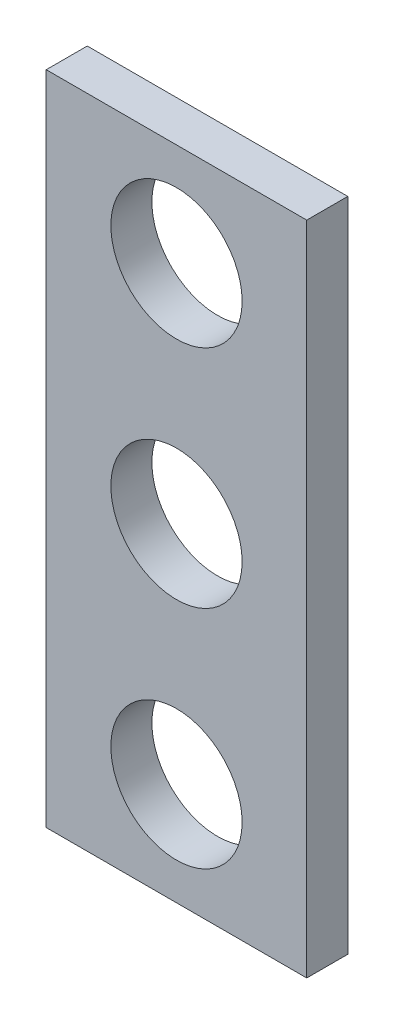
ISO-10303-21;
HEADER;
FILE_DESCRIPTION(('STEP AP214'),'2;1');
FILE_NAME('part.step','',(''),(''),'','','');
FILE_SCHEMA(('AUTOMOTIVE_DESIGN { 1 0 10303 214 1 1 1 1 }'));
ENDSEC;
DATA;
#1=APPLICATION_CONTEXT('core data for automotive mechanical design processes');
#2=APPLICATION_PROTOCOL_DEFINITION('international standard','automotive_design',2000,#1);
#3=PRODUCT_CONTEXT('',#1,'mechanical');
#4=PRODUCT('Part','Part','',(#3));
#5=PRODUCT_RELATED_PRODUCT_CATEGORY('part','',(#4));
#6=PRODUCT_DEFINITION_FORMATION('','',#4);
#7=PRODUCT_DEFINITION_CONTEXT('part definition',#1,'design');
#8=PRODUCT_DEFINITION('design','',#6,#7);
#9=PRODUCT_DEFINITION_SHAPE('','',#8);
#10=(LENGTH_UNIT() NAMED_UNIT(*) SI_UNIT(.MILLI.,.METRE.));
#11=(NAMED_UNIT(*) PLANE_ANGLE_UNIT() SI_UNIT($,.RADIAN.));
#12=(NAMED_UNIT(*) SI_UNIT($,.STERADIAN.) SOLID_ANGLE_UNIT());
#13=UNCERTAINTY_MEASURE_WITH_UNIT(LENGTH_MEASURE(1.E-05),#10,'distance_accuracy_value','');
#14=(GEOMETRIC_REPRESENTATION_CONTEXT(3) GLOBAL_UNCERTAINTY_ASSIGNED_CONTEXT((#13)) GLOBAL_UNIT_ASSIGNED_CONTEXT((#10,
#11,#12)) REPRESENTATION_CONTEXT('',''));
#15=CARTESIAN_POINT('',(0.,0.,0.));
#16=DIRECTION('',(0.,0.,1.));
#17=DIRECTION('',(1.,0.,0.));
#18=AXIS2_PLACEMENT_3D('',#15,#16,#17);
#19=CARTESIAN_POINT('',(-3.175,161.786291501016,1.));
#20=DIRECTION('',(0.,0.,1.));
#21=DIRECTION('',(1.,0.,0.));
#22=AXIS2_PLACEMENT_3D('',#19,#20,#21);
#23=PLANE('',#22);
#24=CARTESIAN_POINT('',(0.,175.286291501016,1.));
#25=DIRECTION('',(0.,0.,1.));
#26=DIRECTION('',(1.,0.,0.));
#27=AXIS2_PLACEMENT_3D('',#24,#25,#26);
#28=CIRCLE('',#27,1.59999999999999);
#29=CARTESIAN_POINT('',(1.59999999999999,175.286291501016,1.));
#30=VERTEX_POINT('',#29);
#31=EDGE_CURVE('E113',#30,#30,#28,.T.);
#32=ORIENTED_EDGE('',*,*,#31,.F.);
#33=EDGE_LOOP('',(#32));
#34=FACE_BOUND('',#33,.T.);
#35=DIRECTION('',(0.,-1.,0.));
#36=VECTOR('',#35,1.);
#37=CARTESIAN_POINT('',(-3.175,177.786291501017,1.));
#38=LINE('',#37,#36);
#39=CARTESIAN_POINT('',(-3.175,177.786291501017,1.));
#40=VERTEX_POINT('',#39);
#41=CARTESIAN_POINT('',(-3.175,161.786291501016,1.));
#42=VERTEX_POINT('',#41);
#43=EDGE_CURVE('E83',#40,#42,#38,.T.);
#44=ORIENTED_EDGE('',*,*,#43,.T.);
#45=DIRECTION('',(1.,0.,0.));
#46=VECTOR('',#45,1.);
#47=CARTESIAN_POINT('',(-3.175,161.786291501016,1.));
#48=LINE('',#47,#46);
#49=CARTESIAN_POINT('',(3.175,161.786291501016,1.));
#50=VERTEX_POINT('',#49);
#51=EDGE_CURVE('E78',#42,#50,#48,.T.);
#52=ORIENTED_EDGE('',*,*,#51,.T.);
#53=DIRECTION('',(0.,1.,0.));
#54=VECTOR('',#53,1.);
#55=CARTESIAN_POINT('',(3.175,177.786291501017,1.));
#56=LINE('',#55,#54);
#57=CARTESIAN_POINT('',(3.175,177.786291501017,1.));
#58=VERTEX_POINT('',#57);
#59=EDGE_CURVE('E81',#50,#58,#56,.T.);
#60=ORIENTED_EDGE('',*,*,#59,.T.);
#61=DIRECTION('',(-1.,0.,0.));
#62=VECTOR('',#61,1.);
#63=CARTESIAN_POINT('',(-3.175,177.786291501017,1.));
#64=LINE('',#63,#62);
#65=EDGE_CURVE('E48',#58,#40,#64,.T.);
#66=ORIENTED_EDGE('',*,*,#65,.T.);
#67=EDGE_LOOP('',(#44,#52,#60,#66));
#68=FACE_BOUND('',#67,.T.);
#69=CARTESIAN_POINT('',(0.,169.786291501016,1.));
#70=DIRECTION('',(0.,0.,1.));
#71=DIRECTION('',(1.,0.,0.));
#72=AXIS2_PLACEMENT_3D('',#69,#70,#71);
#73=CIRCLE('',#72,1.59999999999999);
#74=CARTESIAN_POINT('',(1.59999999999993,169.786291501016,1.));
#75=VERTEX_POINT('',#74);
#76=EDGE_CURVE('E98',#75,#75,#73,.T.);
#77=ORIENTED_EDGE('',*,*,#76,.F.);
#78=EDGE_LOOP('',(#77));
#79=FACE_BOUND('',#78,.T.);
#80=CARTESIAN_POINT('',(0.,164.286291501016,1.));
#81=DIRECTION('',(0.,0.,1.));
#82=DIRECTION('',(1.,0.,0.));
#83=AXIS2_PLACEMENT_3D('',#80,#81,#82);
#84=CIRCLE('',#83,1.59999999999999);
#85=CARTESIAN_POINT('',(1.59999999999999,164.286291501016,1.));
#86=VERTEX_POINT('',#85);
#87=EDGE_CURVE('E119',#86,#86,#84,.T.);
#88=ORIENTED_EDGE('',*,*,#87,.F.);
#89=EDGE_LOOP('',(#88));
#90=FACE_BOUND('',#89,.T.);
#91=ADVANCED_FACE('F31',(#34,#68,#79,#90),#23,.T.);
#92=CARTESIAN_POINT('',(-3.175,161.786291501016,0.));
#93=DIRECTION('',(0.,0.,1.));
#94=DIRECTION('',(1.,0.,0.));
#95=AXIS2_PLACEMENT_3D('',#92,#93,#94);
#96=PLANE('',#95);
#97=CARTESIAN_POINT('',(0.,175.286291501016,0.));
#98=DIRECTION('',(0.,0.,1.));
#99=DIRECTION('',(1.,0.,0.));
#100=AXIS2_PLACEMENT_3D('',#97,#98,#99);
#101=CIRCLE('',#100,1.59999999999999);
#102=CARTESIAN_POINT('',(1.59999999999999,175.286291501016,0.));
#103=VERTEX_POINT('',#102);
#104=EDGE_CURVE('E116',#103,#103,#101,.T.);
#105=ORIENTED_EDGE('',*,*,#104,.T.);
#106=EDGE_LOOP('',(#105));
#107=FACE_BOUND('',#106,.T.);
#108=DIRECTION('',(0.,-1.,0.));
#109=VECTOR('',#108,1.);
#110=CARTESIAN_POINT('',(-3.175,177.786291501017,0.));
#111=LINE('',#110,#109);
#112=CARTESIAN_POINT('',(-3.175,177.786291501017,0.));
#113=VERTEX_POINT('',#112);
#114=CARTESIAN_POINT('',(-3.175,161.786291501016,0.));
#115=VERTEX_POINT('',#114);
#116=EDGE_CURVE('E95',#113,#115,#111,.T.);
#117=ORIENTED_EDGE('',*,*,#116,.F.);
#118=DIRECTION('',(-1.,0.,0.));
#119=VECTOR('',#118,1.);
#120=CARTESIAN_POINT('',(-3.175,177.786291501017,0.));
#121=LINE('',#120,#119);
#122=CARTESIAN_POINT('',(3.175,177.786291501017,0.));
#123=VERTEX_POINT('',#122);
#124=EDGE_CURVE('E71',#123,#113,#121,.T.);
#125=ORIENTED_EDGE('',*,*,#124,.F.);
#126=DIRECTION('',(0.,1.,0.));
#127=VECTOR('',#126,1.);
#128=CARTESIAN_POINT('',(3.175,177.786291501017,0.));
#129=LINE('',#128,#127);
#130=CARTESIAN_POINT('',(3.175,161.786291501016,0.));
#131=VERTEX_POINT('',#130);
#132=EDGE_CURVE('E65',#131,#123,#129,.T.);
#133=ORIENTED_EDGE('',*,*,#132,.F.);
#134=DIRECTION('',(1.,0.,0.));
#135=VECTOR('',#134,1.);
#136=CARTESIAN_POINT('',(-3.175,161.786291501016,0.));
#137=LINE('',#136,#135);
#138=EDGE_CURVE('E87',#115,#131,#137,.T.);
#139=ORIENTED_EDGE('',*,*,#138,.F.);
#140=EDGE_LOOP('',(#117,#125,#133,#139));
#141=FACE_BOUND('',#140,.T.);
#142=CARTESIAN_POINT('',(0.,169.786291501016,0.));
#143=DIRECTION('',(0.,0.,1.));
#144=DIRECTION('',(1.,0.,0.));
#145=AXIS2_PLACEMENT_3D('',#142,#143,#144);
#146=CIRCLE('',#145,1.59999999999999);
#147=CARTESIAN_POINT('',(1.59999999999993,169.786291501016,0.));
#148=VERTEX_POINT('',#147);
#149=EDGE_CURVE('E110',#148,#148,#146,.T.);
#150=ORIENTED_EDGE('',*,*,#149,.T.);
#151=EDGE_LOOP('',(#150));
#152=FACE_BOUND('',#151,.T.);
#153=CARTESIAN_POINT('',(0.,164.286291501016,0.));
#154=DIRECTION('',(0.,0.,1.));
#155=DIRECTION('',(1.,0.,0.));
#156=AXIS2_PLACEMENT_3D('',#153,#154,#155);
#157=CIRCLE('',#156,1.59999999999999);
#158=CARTESIAN_POINT('',(1.59999999999999,164.286291501016,0.));
#159=VERTEX_POINT('',#158);
#160=EDGE_CURVE('E122',#159,#159,#157,.T.);
#161=ORIENTED_EDGE('',*,*,#160,.T.);
#162=EDGE_LOOP('',(#161));
#163=FACE_BOUND('',#162,.T.);
#164=ADVANCED_FACE('F106',(#107,#141,#152,#163),#96,.F.);
#165=CARTESIAN_POINT('',(-3.175,177.786291501017,1.));
#166=DIRECTION('',(1.,0.,0.));
#167=DIRECTION('',(0.,0.,-1.));
#168=AXIS2_PLACEMENT_3D('',#165,#166,#167);
#169=PLANE('',#168);
#170=ORIENTED_EDGE('',*,*,#116,.T.);
#171=DIRECTION('',(0.,0.,-1.));
#172=VECTOR('',#171,1.);
#173=CARTESIAN_POINT('',(-3.175,161.786291501016,1.));
#174=LINE('',#173,#172);
#175=EDGE_CURVE('E11',#42,#115,#174,.T.);
#176=ORIENTED_EDGE('',*,*,#175,.F.);
#177=ORIENTED_EDGE('',*,*,#43,.F.);
#178=DIRECTION('',(0.,0.,-1.));
#179=VECTOR('',#178,1.);
#180=CARTESIAN_POINT('',(-3.175,177.786291501017,1.));
#181=LINE('',#180,#179);
#182=EDGE_CURVE('E91',#40,#113,#181,.T.);
#183=ORIENTED_EDGE('',*,*,#182,.T.);
#184=EDGE_LOOP('',(#170,#176,#177,#183));
#185=FACE_BOUND('',#184,.T.);
#186=ADVANCED_FACE('F33',(#185),#169,.F.);
#187=CARTESIAN_POINT('',(-3.175,161.786291501016,1.));
#188=DIRECTION('',(0.,1.,0.));
#189=DIRECTION('',(0.,0.,1.));
#190=AXIS2_PLACEMENT_3D('',#187,#188,#189);
#191=PLANE('',#190);
#192=ORIENTED_EDGE('',*,*,#138,.T.);
#193=DIRECTION('',(0.,0.,-1.));
#194=VECTOR('',#193,1.);
#195=CARTESIAN_POINT('',(3.175,161.786291501016,1.));
#196=LINE('',#195,#194);
#197=EDGE_CURVE('E40',#50,#131,#196,.T.);
#198=ORIENTED_EDGE('',*,*,#197,.F.);
#199=ORIENTED_EDGE('',*,*,#51,.F.);
#200=ORIENTED_EDGE('',*,*,#175,.T.);
#201=EDGE_LOOP('',(#192,#198,#199,#200));
#202=FACE_BOUND('',#201,.T.);
#203=ADVANCED_FACE('F86',(#202),#191,.F.);
#204=CARTESIAN_POINT('',(3.175,177.786291501017,1.));
#205=DIRECTION('',(-1.,0.,0.));
#206=DIRECTION('',(0.,0.,1.));
#207=AXIS2_PLACEMENT_3D('',#204,#205,#206);
#208=PLANE('',#207);
#209=ORIENTED_EDGE('',*,*,#132,.T.);
#210=DIRECTION('',(0.,0.,-1.));
#211=VECTOR('',#210,1.);
#212=CARTESIAN_POINT('',(3.175,177.786291501017,1.));
#213=LINE('',#212,#211);
#214=EDGE_CURVE('E88',#58,#123,#213,.T.);
#215=ORIENTED_EDGE('',*,*,#214,.F.);
#216=ORIENTED_EDGE('',*,*,#59,.F.);
#217=ORIENTED_EDGE('',*,*,#197,.T.);
#218=EDGE_LOOP('',(#209,#215,#216,#217));
#219=FACE_BOUND('',#218,.T.);
#220=ADVANCED_FACE('F89',(#219),#208,.F.);
#221=CARTESIAN_POINT('',(-3.175,177.786291501017,1.));
#222=DIRECTION('',(0.,-1.,0.));
#223=DIRECTION('',(0.,0.,-1.));
#224=AXIS2_PLACEMENT_3D('',#221,#222,#223);
#225=PLANE('',#224);
#226=ORIENTED_EDGE('',*,*,#124,.T.);
#227=ORIENTED_EDGE('',*,*,#182,.F.);
#228=ORIENTED_EDGE('',*,*,#65,.F.);
#229=ORIENTED_EDGE('',*,*,#214,.T.);
#230=EDGE_LOOP('',(#226,#227,#228,#229));
#231=FACE_BOUND('',#230,.T.);
#232=ADVANCED_FACE('F103',(#231),#225,.F.);
#233=CARTESIAN_POINT('',(0.,169.786291501016,1.));
#234=DIRECTION('',(0.,0.,-1.));
#235=DIRECTION('',(-1.,0.,0.));
#236=AXIS2_PLACEMENT_3D('',#233,#234,#235);
#237=CYLINDRICAL_SURFACE('',#236,1.59999999999999);
#238=ORIENTED_EDGE('',*,*,#76,.T.);
#239=EDGE_LOOP('',(#238));
#240=FACE_BOUND('',#239,.T.);
#241=ORIENTED_EDGE('',*,*,#149,.F.);
#242=EDGE_LOOP('',(#241));
#243=FACE_BOUND('',#242,.T.);
#244=ADVANCED_FACE('F141',(#240,#243),#237,.F.);
#245=CARTESIAN_POINT('',(0.,175.286291501016,1.));
#246=DIRECTION('',(0.,0.,-1.));
#247=DIRECTION('',(-1.,0.,0.));
#248=AXIS2_PLACEMENT_3D('',#245,#246,#247);
#249=CYLINDRICAL_SURFACE('',#248,1.59999999999999);
#250=ORIENTED_EDGE('',*,*,#31,.T.);
#251=EDGE_LOOP('',(#250));
#252=FACE_BOUND('',#251,.T.);
#253=ORIENTED_EDGE('',*,*,#104,.F.);
#254=EDGE_LOOP('',(#253));
#255=FACE_BOUND('',#254,.T.);
#256=ADVANCED_FACE('F187',(#252,#255),#249,.F.);
#257=CARTESIAN_POINT('',(0.,164.286291501016,1.));
#258=DIRECTION('',(0.,0.,-1.));
#259=DIRECTION('',(-1.,0.,0.));
#260=AXIS2_PLACEMENT_3D('',#257,#258,#259);
#261=CYLINDRICAL_SURFACE('',#260,1.59999999999999);
#262=ORIENTED_EDGE('',*,*,#87,.T.);
#263=EDGE_LOOP('',(#262));
#264=FACE_BOUND('',#263,.T.);
#265=ORIENTED_EDGE('',*,*,#160,.F.);
#266=EDGE_LOOP('',(#265));
#267=FACE_BOUND('',#266,.T.);
#268=ADVANCED_FACE('F128',(#264,#267),#261,.F.);
#269=CLOSED_SHELL('',(#91,#164,#186,#203,#220,#232,#244,#256,#268));
#270=MANIFOLD_SOLID_BREP('B2',#269);
#271=ADVANCED_BREP_SHAPE_REPRESENTATION('',(#18,#270),#14);
#272=SHAPE_DEFINITION_REPRESENTATION(#9,#271);
ENDSEC;
END-ISO-10303-21;
